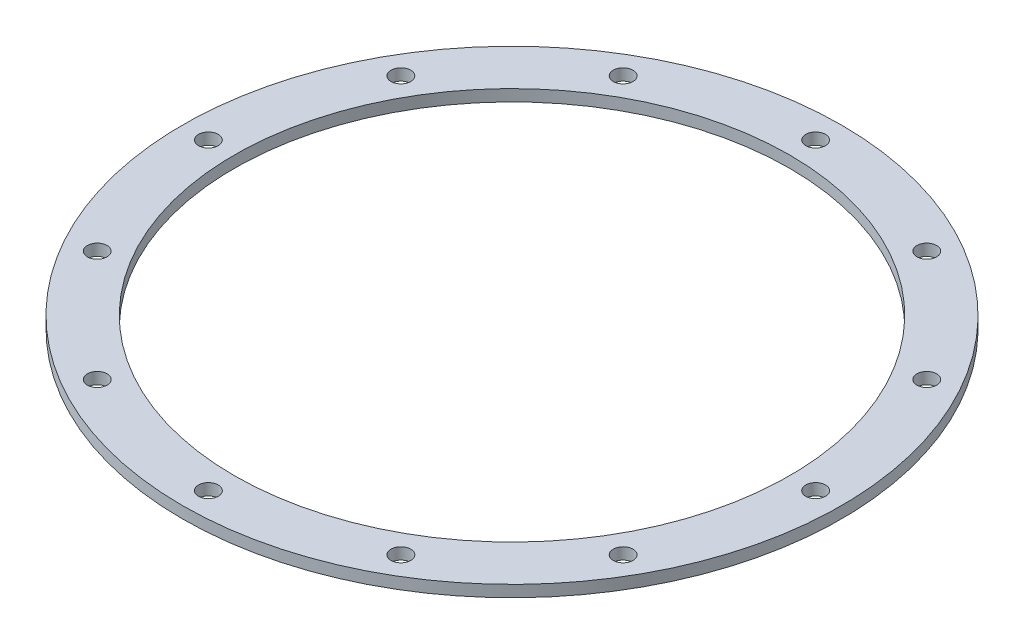
ISO-10303-21;
HEADER;
FILE_DESCRIPTION(('STEP AP214'),'2;1');
FILE_NAME('part.step','',(''),(''),'','','');
FILE_SCHEMA(('AUTOMOTIVE_DESIGN { 1 0 10303 214 1 1 1 1 }'));
ENDSEC;
DATA;
#1=APPLICATION_CONTEXT('core data for automotive mechanical design processes');
#2=APPLICATION_PROTOCOL_DEFINITION('international standard','automotive_design',2000,#1);
#3=PRODUCT_CONTEXT('',#1,'mechanical');
#4=PRODUCT('Part','Part','',(#3));
#5=PRODUCT_RELATED_PRODUCT_CATEGORY('part','',(#4));
#6=PRODUCT_DEFINITION_FORMATION('','',#4);
#7=PRODUCT_DEFINITION_CONTEXT('part definition',#1,'design');
#8=PRODUCT_DEFINITION('design','',#6,#7);
#9=PRODUCT_DEFINITION_SHAPE('','',#8);
#10=(LENGTH_UNIT() NAMED_UNIT(*) SI_UNIT(.MILLI.,.METRE.));
#11=(NAMED_UNIT(*) PLANE_ANGLE_UNIT() SI_UNIT($,.RADIAN.));
#12=(NAMED_UNIT(*) SI_UNIT($,.STERADIAN.) SOLID_ANGLE_UNIT());
#13=UNCERTAINTY_MEASURE_WITH_UNIT(LENGTH_MEASURE(1.E-05),#10,'distance_accuracy_value','');
#14=(GEOMETRIC_REPRESENTATION_CONTEXT(3) GLOBAL_UNCERTAINTY_ASSIGNED_CONTEXT((#13)) GLOBAL_UNIT_ASSIGNED_CONTEXT((#10,
#11,#12)) REPRESENTATION_CONTEXT('',''));
#15=CARTESIAN_POINT('',(0.,0.,0.));
#16=DIRECTION('',(0.,0.,1.));
#17=DIRECTION('',(1.,0.,0.));
#18=AXIS2_PLACEMENT_3D('',#15,#16,#17);
#19=CARTESIAN_POINT('',(0.,55.,0.));
#20=DIRECTION('',(0.,1.,0.));
#21=DIRECTION('',(0.,0.,1.));
#22=AXIS2_PLACEMENT_3D('',#19,#20,#21);
#23=CYLINDRICAL_SURFACE('',#22,38.1);
#24=CARTESIAN_POINT('',(0.,1.58750000000001,0.));
#25=DIRECTION('',(0.,1.,0.));
#26=DIRECTION('',(0.,0.,1.));
#27=AXIS2_PLACEMENT_3D('',#24,#25,#26);
#28=CIRCLE('',#27,38.1);
#29=CARTESIAN_POINT('',(0.,1.58750000000001,38.1));
#30=VERTEX_POINT('',#29);
#31=EDGE_CURVE('E10',#30,#30,#28,.T.);
#32=ORIENTED_EDGE('',*,*,#31,.T.);
#33=EDGE_LOOP('',(#32));
#34=FACE_BOUND('',#33,.T.);
#35=CARTESIAN_POINT('',(0.,0.,0.));
#36=DIRECTION('',(0.,1.,0.));
#37=DIRECTION('',(0.,0.,1.));
#38=AXIS2_PLACEMENT_3D('',#35,#36,#37);
#39=CIRCLE('',#38,38.1);
#40=CARTESIAN_POINT('',(0.,0.,38.1));
#41=VERTEX_POINT('',#40);
#42=EDGE_CURVE('E46',#41,#41,#39,.T.);
#43=ORIENTED_EDGE('',*,*,#42,.F.);
#44=EDGE_LOOP('',(#43));
#45=FACE_BOUND('',#44,.T.);
#46=ADVANCED_FACE('F32',(#34,#45),#23,.F.);
#47=CARTESIAN_POINT('',(-38.1,1.5875,0.));
#48=DIRECTION('',(0.,1.,0.));
#49=DIRECTION('',(0.,0.,1.));
#50=AXIS2_PLACEMENT_3D('',#47,#48,#49);
#51=PLANE('',#50);
#52=CARTESIAN_POINT('',(-36.0751542200448,1.58750000000001,20.8279999999996));
#53=DIRECTION('',(0.,-1.,0.));
#54=DIRECTION('',(0.,0.,-1.));
#55=AXIS2_PLACEMENT_3D('',#52,#53,#54);
#56=CIRCLE('',#55,1.35255);
#57=CARTESIAN_POINT('',(-36.0751542200448,1.58750000000001,19.4754499999996));
#58=VERTEX_POINT('',#57);
#59=EDGE_CURVE('E117',#58,#58,#56,.T.);
#60=ORIENTED_EDGE('',*,*,#59,.T.);
#61=EDGE_LOOP('',(#60));
#62=FACE_BOUND('',#61,.T.);
#63=CARTESIAN_POINT('',(-20.8280000000004,1.58750000000001,36.0751542200444));
#64=DIRECTION('',(0.,-1.,0.));
#65=DIRECTION('',(0.,0.,-1.));
#66=AXIS2_PLACEMENT_3D('',#63,#64,#65);
#67=CIRCLE('',#66,1.35255);
#68=CARTESIAN_POINT('',(-20.8280000000004,1.58750000000001,34.7226042200444));
#69=VERTEX_POINT('',#68);
#70=EDGE_CURVE('E111',#69,#69,#67,.T.);
#71=ORIENTED_EDGE('',*,*,#70,.T.);
#72=EDGE_LOOP('',(#71));
#73=FACE_BOUND('',#72,.T.);
#74=CARTESIAN_POINT('',(-3.57226130743964E-13,1.58750000000001,41.656));
#75=DIRECTION('',(0.,-1.,0.));
#76=DIRECTION('',(0.,0.,-1.));
#77=AXIS2_PLACEMENT_3D('',#74,#75,#76);
#78=CIRCLE('',#77,1.35255);
#79=CARTESIAN_POINT('',(-3.57226130743964E-13,1.58750000000001,40.30345));
#80=VERTEX_POINT('',#79);
#81=EDGE_CURVE('E105',#80,#80,#78,.T.);
#82=ORIENTED_EDGE('',*,*,#81,.T.);
#83=EDGE_LOOP('',(#82));
#84=FACE_BOUND('',#83,.T.);
#85=CARTESIAN_POINT('',(20.8279999999997,1.58750000000001,36.0751542200447));
#86=DIRECTION('',(0.,-1.,0.));
#87=DIRECTION('',(0.,0.,-1.));
#88=AXIS2_PLACEMENT_3D('',#85,#86,#87);
#89=CIRCLE('',#88,1.35255);
#90=CARTESIAN_POINT('',(20.8279999999997,1.58750000000001,34.7226042200447));
#91=VERTEX_POINT('',#90);
#92=EDGE_CURVE('E99',#91,#91,#89,.T.);
#93=ORIENTED_EDGE('',*,*,#92,.T.);
#94=EDGE_LOOP('',(#93));
#95=FACE_BOUND('',#94,.T.);
#96=CARTESIAN_POINT('',(36.0751542200444,1.58750000000001,20.8280000000002));
#97=DIRECTION('',(0.,-1.,0.));
#98=DIRECTION('',(0.,0.,-1.));
#99=AXIS2_PLACEMENT_3D('',#96,#97,#98);
#100=CIRCLE('',#99,1.35255);
#101=CARTESIAN_POINT('',(36.0751542200444,1.58750000000001,19.4754500000002));
#102=VERTEX_POINT('',#101);
#103=EDGE_CURVE('E93',#102,#102,#100,.T.);
#104=ORIENTED_EDGE('',*,*,#103,.T.);
#105=EDGE_LOOP('',(#104));
#106=FACE_BOUND('',#105,.T.);
#107=CARTESIAN_POINT('',(41.656,1.58750000000001,2.30283964218628E-13));
#108=DIRECTION('',(0.,-1.,0.));
#109=DIRECTION('',(0.,0.,-1.));
#110=AXIS2_PLACEMENT_3D('',#107,#108,#109);
#111=CIRCLE('',#110,1.35255);
#112=CARTESIAN_POINT('',(41.656,1.58750000000001,-1.35254999999977));
#113=VERTEX_POINT('',#112);
#114=EDGE_CURVE('E87',#113,#113,#111,.T.);
#115=ORIENTED_EDGE('',*,*,#114,.T.);
#116=EDGE_LOOP('',(#115));
#117=FACE_BOUND('',#116,.T.);
#118=CARTESIAN_POINT('',(36.0751542200447,1.58750000000001,-20.8279999999998));
#119=DIRECTION('',(0.,-1.,0.));
#120=DIRECTION('',(0.,0.,-1.));
#121=AXIS2_PLACEMENT_3D('',#118,#119,#120);
#122=CIRCLE('',#121,1.35255);
#123=CARTESIAN_POINT('',(36.0751542200447,1.58750000000001,-22.1805499999998));
#124=VERTEX_POINT('',#123);
#125=EDGE_CURVE('E81',#124,#124,#122,.T.);
#126=ORIENTED_EDGE('',*,*,#125,.T.);
#127=EDGE_LOOP('',(#126));
#128=FACE_BOUND('',#127,.T.);
#129=CARTESIAN_POINT('',(20.8280000000001,1.58750000000001,-36.0751542200445));
#130=DIRECTION('',(0.,-1.,0.));
#131=DIRECTION('',(0.,0.,-1.));
#132=AXIS2_PLACEMENT_3D('',#129,#130,#131);
#133=CIRCLE('',#132,1.35255);
#134=CARTESIAN_POINT('',(20.8280000000001,1.58750000000001,-37.4277042200445));
#135=VERTEX_POINT('',#134);
#136=EDGE_CURVE('E75',#135,#135,#133,.T.);
#137=ORIENTED_EDGE('',*,*,#136,.T.);
#138=EDGE_LOOP('',(#137));
#139=FACE_BOUND('',#138,.T.);
#140=CARTESIAN_POINT('',(1.1259128775605E-13,1.58750000000001,-41.656));
#141=DIRECTION('',(0.,-1.,0.));
#142=DIRECTION('',(0.,0.,-1.));
#143=AXIS2_PLACEMENT_3D('',#140,#141,#142);
#144=CIRCLE('',#143,1.35255);
#145=CARTESIAN_POINT('',(1.1259128775605E-13,1.58750000000001,-43.00855));
#146=VERTEX_POINT('',#145);
#147=EDGE_CURVE('E69',#146,#146,#144,.T.);
#148=ORIENTED_EDGE('',*,*,#147,.T.);
#149=EDGE_LOOP('',(#148));
#150=FACE_BOUND('',#149,.T.);
#151=CARTESIAN_POINT('',(-20.8279999999999,1.58750000000001,-36.0751542200446));
#152=DIRECTION('',(0.,-1.,0.));
#153=DIRECTION('',(0.,0.,-1.));
#154=AXIS2_PLACEMENT_3D('',#151,#152,#153);
#155=CIRCLE('',#154,1.35255);
#156=CARTESIAN_POINT('',(-20.8279999999999,1.58750000000001,-37.4277042200446));
#157=VERTEX_POINT('',#156);
#158=EDGE_CURVE('E63',#157,#157,#155,.T.);
#159=ORIENTED_EDGE('',*,*,#158,.T.);
#160=EDGE_LOOP('',(#159));
#161=FACE_BOUND('',#160,.T.);
#162=CARTESIAN_POINT('',(-36.0751542200446,1.58750000000001,-20.828));
#163=DIRECTION('',(0.,-1.,0.));
#164=DIRECTION('',(0.,0.,-1.));
#165=AXIS2_PLACEMENT_3D('',#162,#163,#164);
#166=CIRCLE('',#165,1.35255);
#167=CARTESIAN_POINT('',(-36.0751542200446,1.58750000000001,-22.18055));
#168=VERTEX_POINT('',#167);
#169=EDGE_CURVE('E57',#168,#168,#166,.T.);
#170=ORIENTED_EDGE('',*,*,#169,.T.);
#171=EDGE_LOOP('',(#170));
#172=FACE_BOUND('',#171,.T.);
#173=CARTESIAN_POINT('',(-41.656,1.58750000000001,0.));
#174=DIRECTION('',(0.,-1.,0.));
#175=DIRECTION('',(0.,0.,-1.));
#176=AXIS2_PLACEMENT_3D('',#173,#174,#175);
#177=CIRCLE('',#176,1.35255);
#178=CARTESIAN_POINT('',(-41.656,1.58750000000001,-1.35255));
#179=VERTEX_POINT('',#178);
#180=EDGE_CURVE('E51',#179,#179,#177,.T.);
#181=ORIENTED_EDGE('',*,*,#180,.T.);
#182=EDGE_LOOP('',(#181));
#183=FACE_BOUND('',#182,.T.);
#184=CARTESIAN_POINT('',(0.,1.5875,0.));
#185=DIRECTION('',(0.,1.,0.));
#186=DIRECTION('',(0.,0.,1.));
#187=AXIS2_PLACEMENT_3D('',#184,#185,#186);
#188=CIRCLE('',#187,45.212);
#189=CARTESIAN_POINT('',(0.,1.5875,45.212));
#190=VERTEX_POINT('',#189);
#191=EDGE_CURVE('E38',#190,#190,#188,.T.);
#192=ORIENTED_EDGE('',*,*,#191,.T.);
#193=EDGE_LOOP('',(#192));
#194=FACE_BOUND('',#193,.T.);
#195=ORIENTED_EDGE('',*,*,#31,.F.);
#196=EDGE_LOOP('',(#195));
#197=FACE_BOUND('',#196,.T.);
#198=ADVANCED_FACE('F160',(#62,#73,#84,#95,#106,#117,#128,#139,#150,#161,#172,#183,#194,#197),
#51,.T.);
#199=CARTESIAN_POINT('',(0.,55.,0.));
#200=DIRECTION('',(0.,1.,0.));
#201=DIRECTION('',(0.,0.,1.));
#202=AXIS2_PLACEMENT_3D('',#199,#200,#201);
#203=CYLINDRICAL_SURFACE('',#202,45.212);
#204=CARTESIAN_POINT('',(0.,0.,0.));
#205=DIRECTION('',(0.,1.,0.));
#206=DIRECTION('',(0.,0.,1.));
#207=AXIS2_PLACEMENT_3D('',#204,#205,#206);
#208=CIRCLE('',#207,45.212);
#209=CARTESIAN_POINT('',(0.,0.,45.212));
#210=VERTEX_POINT('',#209);
#211=EDGE_CURVE('E42',#210,#210,#208,.T.);
#212=ORIENTED_EDGE('',*,*,#211,.T.);
#213=EDGE_LOOP('',(#212));
#214=FACE_BOUND('',#213,.T.);
#215=ORIENTED_EDGE('',*,*,#191,.F.);
#216=EDGE_LOOP('',(#215));
#217=FACE_BOUND('',#216,.T.);
#218=ADVANCED_FACE('F130',(#214,#217),#203,.T.);
#219=CARTESIAN_POINT('',(-38.1,0.,0.));
#220=DIRECTION('',(0.,-1.,0.));
#221=DIRECTION('',(0.,0.,-1.));
#222=AXIS2_PLACEMENT_3D('',#219,#220,#221);
#223=PLANE('',#222);
#224=CARTESIAN_POINT('',(-36.0751542200448,0.,20.8279999999996));
#225=DIRECTION('',(0.,-1.,0.));
#226=DIRECTION('',(0.,0.,-1.));
#227=AXIS2_PLACEMENT_3D('',#224,#225,#226);
#228=CIRCLE('',#227,1.35255);
#229=CARTESIAN_POINT('',(-36.0751542200448,0.,19.4754499999996));
#230=VERTEX_POINT('',#229);
#231=EDGE_CURVE('E120',#230,#230,#228,.T.);
#232=ORIENTED_EDGE('',*,*,#231,.F.);
#233=EDGE_LOOP('',(#232));
#234=FACE_BOUND('',#233,.T.);
#235=CARTESIAN_POINT('',(-20.8280000000004,0.,36.0751542200444));
#236=DIRECTION('',(0.,-1.,0.));
#237=DIRECTION('',(0.,0.,-1.));
#238=AXIS2_PLACEMENT_3D('',#235,#236,#237);
#239=CIRCLE('',#238,1.35255);
#240=CARTESIAN_POINT('',(-20.8280000000004,0.,34.7226042200444));
#241=VERTEX_POINT('',#240);
#242=EDGE_CURVE('E114',#241,#241,#239,.T.);
#243=ORIENTED_EDGE('',*,*,#242,.F.);
#244=EDGE_LOOP('',(#243));
#245=FACE_BOUND('',#244,.T.);
#246=CARTESIAN_POINT('',(-3.57226130743964E-13,0.,41.656));
#247=DIRECTION('',(0.,-1.,0.));
#248=DIRECTION('',(0.,0.,-1.));
#249=AXIS2_PLACEMENT_3D('',#246,#247,#248);
#250=CIRCLE('',#249,1.35255);
#251=CARTESIAN_POINT('',(-3.57226130743964E-13,0.,40.30345));
#252=VERTEX_POINT('',#251);
#253=EDGE_CURVE('E108',#252,#252,#250,.T.);
#254=ORIENTED_EDGE('',*,*,#253,.F.);
#255=EDGE_LOOP('',(#254));
#256=FACE_BOUND('',#255,.T.);
#257=CARTESIAN_POINT('',(20.8279999999997,0.,36.0751542200447));
#258=DIRECTION('',(0.,-1.,0.));
#259=DIRECTION('',(0.,0.,-1.));
#260=AXIS2_PLACEMENT_3D('',#257,#258,#259);
#261=CIRCLE('',#260,1.35255);
#262=CARTESIAN_POINT('',(20.8279999999997,0.,34.7226042200447));
#263=VERTEX_POINT('',#262);
#264=EDGE_CURVE('E102',#263,#263,#261,.T.);
#265=ORIENTED_EDGE('',*,*,#264,.F.);
#266=EDGE_LOOP('',(#265));
#267=FACE_BOUND('',#266,.T.);
#268=CARTESIAN_POINT('',(36.0751542200444,0.,20.8280000000002));
#269=DIRECTION('',(0.,-1.,0.));
#270=DIRECTION('',(0.,0.,-1.));
#271=AXIS2_PLACEMENT_3D('',#268,#269,#270);
#272=CIRCLE('',#271,1.35255);
#273=CARTESIAN_POINT('',(36.0751542200444,0.,19.4754500000002));
#274=VERTEX_POINT('',#273);
#275=EDGE_CURVE('E96',#274,#274,#272,.T.);
#276=ORIENTED_EDGE('',*,*,#275,.F.);
#277=EDGE_LOOP('',(#276));
#278=FACE_BOUND('',#277,.T.);
#279=CARTESIAN_POINT('',(41.656,0.,2.30283964218628E-13));
#280=DIRECTION('',(0.,-1.,0.));
#281=DIRECTION('',(0.,0.,-1.));
#282=AXIS2_PLACEMENT_3D('',#279,#280,#281);
#283=CIRCLE('',#282,1.35255);
#284=CARTESIAN_POINT('',(41.656,0.,-1.35254999999977));
#285=VERTEX_POINT('',#284);
#286=EDGE_CURVE('E90',#285,#285,#283,.T.);
#287=ORIENTED_EDGE('',*,*,#286,.F.);
#288=EDGE_LOOP('',(#287));
#289=FACE_BOUND('',#288,.T.);
#290=CARTESIAN_POINT('',(36.0751542200447,0.,-20.8279999999998));
#291=DIRECTION('',(0.,-1.,0.));
#292=DIRECTION('',(0.,0.,-1.));
#293=AXIS2_PLACEMENT_3D('',#290,#291,#292);
#294=CIRCLE('',#293,1.35255);
#295=CARTESIAN_POINT('',(36.0751542200447,0.,-22.1805499999998));
#296=VERTEX_POINT('',#295);
#297=EDGE_CURVE('E84',#296,#296,#294,.T.);
#298=ORIENTED_EDGE('',*,*,#297,.F.);
#299=EDGE_LOOP('',(#298));
#300=FACE_BOUND('',#299,.T.);
#301=CARTESIAN_POINT('',(20.8280000000001,0.,-36.0751542200445));
#302=DIRECTION('',(0.,-1.,0.));
#303=DIRECTION('',(0.,0.,-1.));
#304=AXIS2_PLACEMENT_3D('',#301,#302,#303);
#305=CIRCLE('',#304,1.35255);
#306=CARTESIAN_POINT('',(20.8280000000001,0.,-37.4277042200445));
#307=VERTEX_POINT('',#306);
#308=EDGE_CURVE('E78',#307,#307,#305,.T.);
#309=ORIENTED_EDGE('',*,*,#308,.F.);
#310=EDGE_LOOP('',(#309));
#311=FACE_BOUND('',#310,.T.);
#312=CARTESIAN_POINT('',(1.1259128775605E-13,0.,-41.656));
#313=DIRECTION('',(0.,-1.,0.));
#314=DIRECTION('',(0.,0.,-1.));
#315=AXIS2_PLACEMENT_3D('',#312,#313,#314);
#316=CIRCLE('',#315,1.35255);
#317=CARTESIAN_POINT('',(1.1259128775605E-13,0.,-43.00855));
#318=VERTEX_POINT('',#317);
#319=EDGE_CURVE('E72',#318,#318,#316,.T.);
#320=ORIENTED_EDGE('',*,*,#319,.F.);
#321=EDGE_LOOP('',(#320));
#322=FACE_BOUND('',#321,.T.);
#323=CARTESIAN_POINT('',(-20.8279999999999,0.,-36.0751542200446));
#324=DIRECTION('',(0.,-1.,0.));
#325=DIRECTION('',(0.,0.,-1.));
#326=AXIS2_PLACEMENT_3D('',#323,#324,#325);
#327=CIRCLE('',#326,1.35255);
#328=CARTESIAN_POINT('',(-20.8279999999999,0.,-37.4277042200446));
#329=VERTEX_POINT('',#328);
#330=EDGE_CURVE('E66',#329,#329,#327,.T.);
#331=ORIENTED_EDGE('',*,*,#330,.F.);
#332=EDGE_LOOP('',(#331));
#333=FACE_BOUND('',#332,.T.);
#334=CARTESIAN_POINT('',(-36.0751542200446,0.,-20.828));
#335=DIRECTION('',(0.,-1.,0.));
#336=DIRECTION('',(0.,0.,-1.));
#337=AXIS2_PLACEMENT_3D('',#334,#335,#336);
#338=CIRCLE('',#337,1.35255);
#339=CARTESIAN_POINT('',(-36.0751542200446,0.,-22.18055));
#340=VERTEX_POINT('',#339);
#341=EDGE_CURVE('E60',#340,#340,#338,.T.);
#342=ORIENTED_EDGE('',*,*,#341,.F.);
#343=EDGE_LOOP('',(#342));
#344=FACE_BOUND('',#343,.T.);
#345=CARTESIAN_POINT('',(-41.656,0.,0.));
#346=DIRECTION('',(0.,-1.,0.));
#347=DIRECTION('',(0.,0.,-1.));
#348=AXIS2_PLACEMENT_3D('',#345,#346,#347);
#349=CIRCLE('',#348,1.35255);
#350=CARTESIAN_POINT('',(-41.656,0.,-1.35255));
#351=VERTEX_POINT('',#350);
#352=EDGE_CURVE('E54',#351,#351,#349,.T.);
#353=ORIENTED_EDGE('',*,*,#352,.F.);
#354=EDGE_LOOP('',(#353));
#355=FACE_BOUND('',#354,.T.);
#356=ORIENTED_EDGE('',*,*,#42,.T.);
#357=EDGE_LOOP('',(#356));
#358=FACE_BOUND('',#357,.T.);
#359=ORIENTED_EDGE('',*,*,#211,.F.);
#360=EDGE_LOOP('',(#359));
#361=FACE_BOUND('',#360,.T.);
#362=ADVANCED_FACE('F126',(#234,#245,#256,#267,#278,#289,#300,#311,#322,#333,#344,#355,#358,
#361),#223,.T.);
#363=CARTESIAN_POINT('',(-41.656,0.,0.));
#364=DIRECTION('',(0.,-1.,0.));
#365=DIRECTION('',(0.,0.,-1.));
#366=AXIS2_PLACEMENT_3D('',#363,#364,#365);
#367=CYLINDRICAL_SURFACE('',#366,1.35255);
#368=ORIENTED_EDGE('',*,*,#180,.F.);
#369=EDGE_LOOP('',(#368));
#370=FACE_BOUND('',#369,.T.);
#371=ORIENTED_EDGE('',*,*,#352,.T.);
#372=EDGE_LOOP('',(#371));
#373=FACE_BOUND('',#372,.T.);
#374=ADVANCED_FACE('F129',(#370,#373),#367,.F.);
#375=CARTESIAN_POINT('',(-36.0751542200446,0.,-20.828));
#376=DIRECTION('',(0.,-1.,0.));
#377=DIRECTION('',(0.,0.,-1.));
#378=AXIS2_PLACEMENT_3D('',#375,#376,#377);
#379=CYLINDRICAL_SURFACE('',#378,1.35255);
#380=ORIENTED_EDGE('',*,*,#169,.F.);
#381=EDGE_LOOP('',(#380));
#382=FACE_BOUND('',#381,.T.);
#383=ORIENTED_EDGE('',*,*,#341,.T.);
#384=EDGE_LOOP('',(#383));
#385=FACE_BOUND('',#384,.T.);
#386=ADVANCED_FACE('F191',(#382,#385),#379,.F.);
#387=CARTESIAN_POINT('',(-20.8279999999999,0.,-36.0751542200446));
#388=DIRECTION('',(0.,-1.,0.));
#389=DIRECTION('',(0.,0.,-1.));
#390=AXIS2_PLACEMENT_3D('',#387,#388,#389);
#391=CYLINDRICAL_SURFACE('',#390,1.35255);
#392=ORIENTED_EDGE('',*,*,#158,.F.);
#393=EDGE_LOOP('',(#392));
#394=FACE_BOUND('',#393,.T.);
#395=ORIENTED_EDGE('',*,*,#330,.T.);
#396=EDGE_LOOP('',(#395));
#397=FACE_BOUND('',#396,.T.);
#398=ADVANCED_FACE('F196',(#394,#397),#391,.F.);
#399=CARTESIAN_POINT('',(1.1259128775605E-13,0.,-41.656));
#400=DIRECTION('',(0.,-1.,0.));
#401=DIRECTION('',(0.,0.,-1.));
#402=AXIS2_PLACEMENT_3D('',#399,#400,#401);
#403=CYLINDRICAL_SURFACE('',#402,1.35255);
#404=ORIENTED_EDGE('',*,*,#147,.F.);
#405=EDGE_LOOP('',(#404));
#406=FACE_BOUND('',#405,.T.);
#407=ORIENTED_EDGE('',*,*,#319,.T.);
#408=EDGE_LOOP('',(#407));
#409=FACE_BOUND('',#408,.T.);
#410=ADVANCED_FACE('F206',(#406,#409),#403,.F.);
#411=CARTESIAN_POINT('',(20.8280000000001,0.,-36.0751542200445));
#412=DIRECTION('',(0.,-1.,0.));
#413=DIRECTION('',(0.,0.,-1.));
#414=AXIS2_PLACEMENT_3D('',#411,#412,#413);
#415=CYLINDRICAL_SURFACE('',#414,1.35255);
#416=ORIENTED_EDGE('',*,*,#136,.F.);
#417=EDGE_LOOP('',(#416));
#418=FACE_BOUND('',#417,.T.);
#419=ORIENTED_EDGE('',*,*,#308,.T.);
#420=EDGE_LOOP('',(#419));
#421=FACE_BOUND('',#420,.T.);
#422=ADVANCED_FACE('F216',(#418,#421),#415,.F.);
#423=CARTESIAN_POINT('',(36.0751542200447,0.,-20.8279999999998));
#424=DIRECTION('',(0.,-1.,0.));
#425=DIRECTION('',(0.,0.,-1.));
#426=AXIS2_PLACEMENT_3D('',#423,#424,#425);
#427=CYLINDRICAL_SURFACE('',#426,1.35255);
#428=ORIENTED_EDGE('',*,*,#125,.F.);
#429=EDGE_LOOP('',(#428));
#430=FACE_BOUND('',#429,.T.);
#431=ORIENTED_EDGE('',*,*,#297,.T.);
#432=EDGE_LOOP('',(#431));
#433=FACE_BOUND('',#432,.T.);
#434=ADVANCED_FACE('F226',(#430,#433),#427,.F.);
#435=CARTESIAN_POINT('',(41.656,0.,2.30283964218628E-13));
#436=DIRECTION('',(0.,-1.,0.));
#437=DIRECTION('',(0.,0.,-1.));
#438=AXIS2_PLACEMENT_3D('',#435,#436,#437);
#439=CYLINDRICAL_SURFACE('',#438,1.35255);
#440=ORIENTED_EDGE('',*,*,#114,.F.);
#441=EDGE_LOOP('',(#440));
#442=FACE_BOUND('',#441,.T.);
#443=ORIENTED_EDGE('',*,*,#286,.T.);
#444=EDGE_LOOP('',(#443));
#445=FACE_BOUND('',#444,.T.);
#446=ADVANCED_FACE('F236',(#442,#445),#439,.F.);
#447=CARTESIAN_POINT('',(36.0751542200444,0.,20.8280000000002));
#448=DIRECTION('',(0.,-1.,0.));
#449=DIRECTION('',(0.,0.,-1.));
#450=AXIS2_PLACEMENT_3D('',#447,#448,#449);
#451=CYLINDRICAL_SURFACE('',#450,1.35255);
#452=ORIENTED_EDGE('',*,*,#103,.F.);
#453=EDGE_LOOP('',(#452));
#454=FACE_BOUND('',#453,.T.);
#455=ORIENTED_EDGE('',*,*,#275,.T.);
#456=EDGE_LOOP('',(#455));
#457=FACE_BOUND('',#456,.T.);
#458=ADVANCED_FACE('F246',(#454,#457),#451,.F.);
#459=CARTESIAN_POINT('',(20.8279999999997,0.,36.0751542200447));
#460=DIRECTION('',(0.,-1.,0.));
#461=DIRECTION('',(0.,0.,-1.));
#462=AXIS2_PLACEMENT_3D('',#459,#460,#461);
#463=CYLINDRICAL_SURFACE('',#462,1.35255);
#464=ORIENTED_EDGE('',*,*,#92,.F.);
#465=EDGE_LOOP('',(#464));
#466=FACE_BOUND('',#465,.T.);
#467=ORIENTED_EDGE('',*,*,#264,.T.);
#468=EDGE_LOOP('',(#467));
#469=FACE_BOUND('',#468,.T.);
#470=ADVANCED_FACE('F256',(#466,#469),#463,.F.);
#471=CARTESIAN_POINT('',(-3.57226130743964E-13,0.,41.656));
#472=DIRECTION('',(0.,-1.,0.));
#473=DIRECTION('',(0.,0.,-1.));
#474=AXIS2_PLACEMENT_3D('',#471,#472,#473);
#475=CYLINDRICAL_SURFACE('',#474,1.35255);
#476=ORIENTED_EDGE('',*,*,#81,.F.);
#477=EDGE_LOOP('',(#476));
#478=FACE_BOUND('',#477,.T.);
#479=ORIENTED_EDGE('',*,*,#253,.T.);
#480=EDGE_LOOP('',(#479));
#481=FACE_BOUND('',#480,.T.);
#482=ADVANCED_FACE('F266',(#478,#481),#475,.F.);
#483=CARTESIAN_POINT('',(-20.8280000000004,0.,36.0751542200444));
#484=DIRECTION('',(0.,-1.,0.));
#485=DIRECTION('',(0.,0.,-1.));
#486=AXIS2_PLACEMENT_3D('',#483,#484,#485);
#487=CYLINDRICAL_SURFACE('',#486,1.35255);
#488=ORIENTED_EDGE('',*,*,#70,.F.);
#489=EDGE_LOOP('',(#488));
#490=FACE_BOUND('',#489,.T.);
#491=ORIENTED_EDGE('',*,*,#242,.T.);
#492=EDGE_LOOP('',(#491));
#493=FACE_BOUND('',#492,.T.);
#494=ADVANCED_FACE('F276',(#490,#493),#487,.F.);
#495=CARTESIAN_POINT('',(-36.0751542200448,0.,20.8279999999996));
#496=DIRECTION('',(0.,-1.,0.));
#497=DIRECTION('',(0.,0.,-1.));
#498=AXIS2_PLACEMENT_3D('',#495,#496,#497);
#499=CYLINDRICAL_SURFACE('',#498,1.35255);
#500=ORIENTED_EDGE('',*,*,#59,.F.);
#501=EDGE_LOOP('',(#500));
#502=FACE_BOUND('',#501,.T.);
#503=ORIENTED_EDGE('',*,*,#231,.T.);
#504=EDGE_LOOP('',(#503));
#505=FACE_BOUND('',#504,.T.);
#506=ADVANCED_FACE('F124',(#502,#505),#499,.F.);
#507=CLOSED_SHELL('',(#46,#198,#218,#362,#374,#386,#398,#410,#422,#434,#446,#458,#470,#482,#494,#506));
#508=MANIFOLD_SOLID_BREP('B2',#507);
#509=ADVANCED_BREP_SHAPE_REPRESENTATION('',(#18,#508),#14);
#510=SHAPE_DEFINITION_REPRESENTATION(#9,#509);
ENDSEC;
END-ISO-10303-21;
